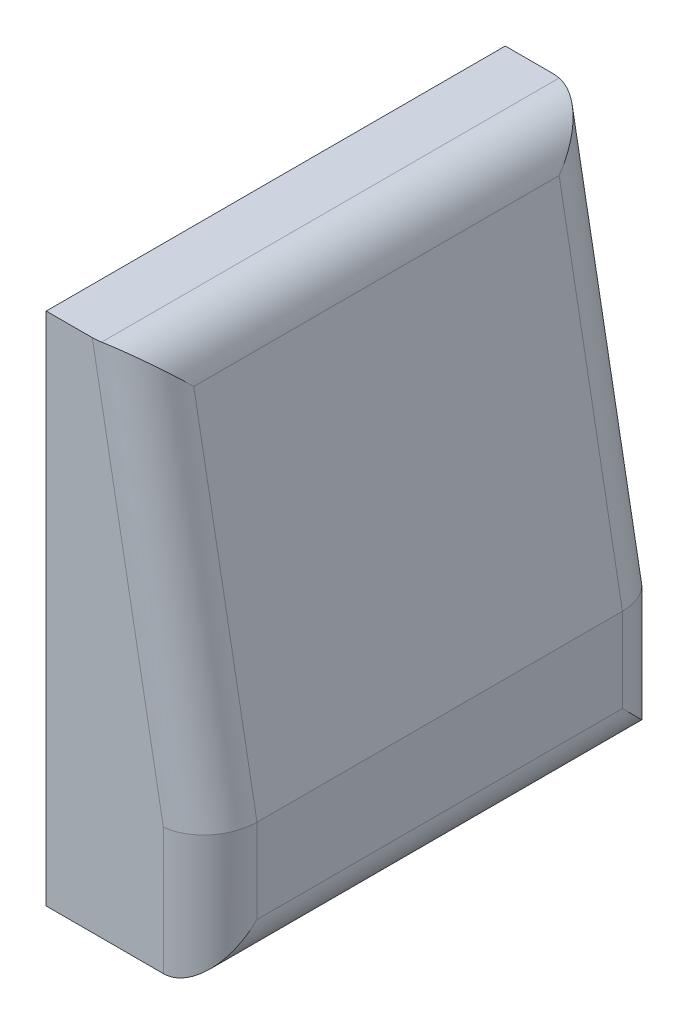
ISO-10303-21;
HEADER;
FILE_DESCRIPTION(('STEP AP214'),'2;1');
FILE_NAME('part.step','',(''),(''),'','','');
FILE_SCHEMA(('AUTOMOTIVE_DESIGN { 1 0 10303 214 1 1 1 1 }'));
ENDSEC;
DATA;
#1=APPLICATION_CONTEXT('core data for automotive mechanical design processes');
#2=APPLICATION_PROTOCOL_DEFINITION('international standard','automotive_design',2000,#1);
#3=PRODUCT_CONTEXT('',#1,'mechanical');
#4=PRODUCT('Part','Part','',(#3));
#5=PRODUCT_RELATED_PRODUCT_CATEGORY('part','',(#4));
#6=PRODUCT_DEFINITION_FORMATION('','',#4);
#7=PRODUCT_DEFINITION_CONTEXT('part definition',#1,'design');
#8=PRODUCT_DEFINITION('design','',#6,#7);
#9=PRODUCT_DEFINITION_SHAPE('','',#8);
#10=(LENGTH_UNIT() NAMED_UNIT(*) SI_UNIT(.MILLI.,.METRE.));
#11=(NAMED_UNIT(*) PLANE_ANGLE_UNIT() SI_UNIT($,.RADIAN.));
#12=(NAMED_UNIT(*) SI_UNIT($,.STERADIAN.) SOLID_ANGLE_UNIT());
#13=UNCERTAINTY_MEASURE_WITH_UNIT(LENGTH_MEASURE(1.E-05),#10,'distance_accuracy_value','');
#14=(GEOMETRIC_REPRESENTATION_CONTEXT(3) GLOBAL_UNCERTAINTY_ASSIGNED_CONTEXT((#13)) GLOBAL_UNIT_ASSIGNED_CONTEXT((#10,
#11,#12)) REPRESENTATION_CONTEXT('',''));
#15=CARTESIAN_POINT('',(0.,0.,0.));
#16=DIRECTION('',(0.,0.,1.));
#17=DIRECTION('',(1.,0.,0.));
#18=AXIS2_PLACEMENT_3D('',#15,#16,#17);
#19=CARTESIAN_POINT('',(200.,1100.,490.));
#20=DIRECTION('',(0.,-1.,0.));
#21=DIRECTION('',(0.,0.,-1.));
#22=AXIS2_PLACEMENT_3D('',#19,#20,#21);
#23=PLANE('',#22);
#24=DIRECTION('',(0.,0.,-1.));
#25=VECTOR('',#24,1.);
#26=CARTESIAN_POINT('',(116.633338798208,1100.,490.));
#27=LINE('',#26,#25);
#28=CARTESIAN_POINT('',(116.633338798208,1100.,488.367740670723));
#29=VERTEX_POINT('',#28);
#30=CARTESIAN_POINT('',(116.633338798208,1100.,-488.367740670723));
#31=VERTEX_POINT('',#30);
#32=EDGE_CURVE('E167',#29,#31,#27,.T.);
#33=ORIENTED_EDGE('',*,*,#32,.T.);
#34=CARTESIAN_POINT('',(98.3406558713784,1100.,-390.));
#35=DIRECTION('',(0.,-1.,0.));
#36=DIRECTION('',(-1.,0.,0.));
#37=AXIS2_PLACEMENT_3D('',#34,#35,#36);
#38=ELLIPSE('',#37,101.659344128622,100.);
#39=CARTESIAN_POINT('',(98.3406558713784,1100.,-490.));
#40=VERTEX_POINT('',#39);
#41=EDGE_CURVE('E173',#31,#40,#38,.F.);
#42=ORIENTED_EDGE('',*,*,#41,.T.);
#43=DIRECTION('',(-1.,0.,0.));
#44=VECTOR('',#43,1.);
#45=CARTESIAN_POINT('',(200.,1100.,-490.));
#46=LINE('',#45,#44);
#47=CARTESIAN_POINT('',(0.,1100.,-490.));
#48=VERTEX_POINT('',#47);
#49=EDGE_CURVE('E132',#40,#48,#46,.T.);
#50=ORIENTED_EDGE('',*,*,#49,.T.);
#51=DIRECTION('',(0.,0.,-1.));
#52=VECTOR('',#51,1.);
#53=CARTESIAN_POINT('',(0.,1100.,490.));
#54=LINE('',#53,#52);
#55=CARTESIAN_POINT('',(0.,1100.,490.));
#56=VERTEX_POINT('',#55);
#57=EDGE_CURVE('E125',#56,#48,#54,.T.);
#58=ORIENTED_EDGE('',*,*,#57,.F.);
#59=DIRECTION('',(-1.,0.,0.));
#60=VECTOR('',#59,1.);
#61=CARTESIAN_POINT('',(200.,1100.,490.));
#62=LINE('',#61,#60);
#63=CARTESIAN_POINT('',(98.3406558713784,1100.,490.));
#64=VERTEX_POINT('',#63);
#65=EDGE_CURVE('E111',#64,#56,#62,.T.);
#66=ORIENTED_EDGE('',*,*,#65,.F.);
#67=CARTESIAN_POINT('',(98.3406558713784,1100.,390.));
#68=DIRECTION('',(0.,-1.,0.));
#69=DIRECTION('',(1.,0.,0.));
#70=AXIS2_PLACEMENT_3D('',#67,#68,#69);
#71=ELLIPSE('',#70,101.659344128622,100.);
#72=EDGE_CURVE('E170',#64,#29,#71,.F.);
#73=ORIENTED_EDGE('',*,*,#72,.T.);
#74=EDGE_LOOP('',(#33,#42,#50,#58,#66,#73));
#75=FACE_BOUND('',#74,.T.);
#76=ADVANCED_FACE('F39',(#75),#23,.F.);
#77=CARTESIAN_POINT('',(0.,1100.,490.));
#78=DIRECTION('',(1.,0.,0.));
#79=DIRECTION('',(0.,0.,-1.));
#80=AXIS2_PLACEMENT_3D('',#77,#78,#79);
#81=PLANE('',#80);
#82=DIRECTION('',(0.,-1.,0.));
#83=VECTOR('',#82,1.);
#84=CARTESIAN_POINT('',(0.,1100.,-490.));
#85=LINE('',#84,#83);
#86=CARTESIAN_POINT('',(0.,0.,-490.));
#87=VERTEX_POINT('',#86);
#88=EDGE_CURVE('E206',#48,#87,#85,.T.);
#89=ORIENTED_EDGE('',*,*,#88,.T.);
#90=DIRECTION('',(0.,0.,-1.));
#91=VECTOR('',#90,1.);
#92=CARTESIAN_POINT('',(0.,0.,490.));
#93=LINE('',#92,#91);
#94=CARTESIAN_POINT('',(0.,0.,490.));
#95=VERTEX_POINT('',#94);
#96=EDGE_CURVE('E127',#95,#87,#93,.T.);
#97=ORIENTED_EDGE('',*,*,#96,.F.);
#98=DIRECTION('',(0.,-1.,0.));
#99=VECTOR('',#98,1.);
#100=CARTESIAN_POINT('',(0.,1100.,490.));
#101=LINE('',#100,#99);
#102=EDGE_CURVE('E114',#56,#95,#101,.T.);
#103=ORIENTED_EDGE('',*,*,#102,.F.);
#104=ORIENTED_EDGE('',*,*,#57,.T.);
#105=EDGE_LOOP('',(#89,#97,#103,#104));
#106=FACE_BOUND('',#105,.T.);
#107=ADVANCED_FACE('F124',(#106),#81,.F.);
#108=CARTESIAN_POINT('',(0.,0.,490.));
#109=DIRECTION('',(0.,1.,0.));
#110=DIRECTION('',(0.,0.,1.));
#111=AXIS2_PLACEMENT_3D('',#108,#109,#110);
#112=PLANE('',#111);
#113=DIRECTION('',(1.,0.,0.));
#114=VECTOR('',#113,1.);
#115=CARTESIAN_POINT('',(0.,0.,-490.));
#116=LINE('',#115,#114);
#117=CARTESIAN_POINT('',(250.,0.,-490.));
#118=VERTEX_POINT('',#117);
#119=EDGE_CURVE('E120',#87,#118,#116,.T.);
#120=ORIENTED_EDGE('',*,*,#119,.T.);
#121=DIRECTION('',(0.,0.,-1.));
#122=VECTOR('',#121,1.);
#123=CARTESIAN_POINT('',(250.,0.,490.));
#124=LINE('',#123,#122);
#125=CARTESIAN_POINT('',(250.,0.,490.));
#126=VERTEX_POINT('',#125);
#127=EDGE_CURVE('E63',#118,#126,#124,.F.);
#128=ORIENTED_EDGE('',*,*,#127,.T.);
#129=DIRECTION('',(1.,0.,0.));
#130=VECTOR('',#129,1.);
#131=CARTESIAN_POINT('',(0.,0.,490.));
#132=LINE('',#131,#130);
#133=EDGE_CURVE('E129',#95,#126,#132,.T.);
#134=ORIENTED_EDGE('',*,*,#133,.F.);
#135=ORIENTED_EDGE('',*,*,#96,.T.);
#136=EDGE_LOOP('',(#120,#128,#134,#135));
#137=FACE_BOUND('',#136,.T.);
#138=ADVANCED_FACE('F251',(#137),#112,.F.);
#139=CARTESIAN_POINT('',(350.,0.,490.));
#140=DIRECTION('',(-1.,0.,0.));
#141=DIRECTION('',(0.,0.,1.));
#142=AXIS2_PLACEMENT_3D('',#139,#140,#141);
#143=PLANE('',#142);
#144=DIRECTION('',(0.,0.,-1.));
#145=VECTOR('',#144,1.);
#146=CARTESIAN_POINT('',(350.,100.,490.));
#147=LINE('',#146,#145);
#148=CARTESIAN_POINT('',(350.,100.,390.));
#149=VERTEX_POINT('',#148);
#150=CARTESIAN_POINT('',(350.,100.,-390.));
#151=VERTEX_POINT('',#150);
#152=EDGE_CURVE('E139',#149,#151,#147,.T.);
#153=ORIENTED_EDGE('',*,*,#152,.T.);
#154=DIRECTION('',(0.,1.,0.));
#155=VECTOR('',#154,1.);
#156=CARTESIAN_POINT('',(350.,0.,-390.));
#157=LINE('',#156,#155);
#158=CARTESIAN_POINT('',(350.,280.,-390.));
#159=VERTEX_POINT('',#158);
#160=EDGE_CURVE('E147',#151,#159,#157,.T.);
#161=ORIENTED_EDGE('',*,*,#160,.T.);
#162=DIRECTION('',(0.,0.,-1.));
#163=VECTOR('',#162,1.);
#164=CARTESIAN_POINT('',(350.,280.,490.));
#165=LINE('',#164,#163);
#166=CARTESIAN_POINT('',(350.,280.,390.));
#167=VERTEX_POINT('',#166);
#168=EDGE_CURVE('E141',#167,#159,#165,.T.);
#169=ORIENTED_EDGE('',*,*,#168,.F.);
#170=DIRECTION('',(0.,1.,0.));
#171=VECTOR('',#170,1.);
#172=CARTESIAN_POINT('',(350.,0.,390.));
#173=LINE('',#172,#171);
#174=EDGE_CURVE('E135',#167,#149,#173,.F.);
#175=ORIENTED_EDGE('',*,*,#174,.T.);
#176=EDGE_LOOP('',(#153,#161,#169,#175));
#177=FACE_BOUND('',#176,.T.);
#178=ADVANCED_FACE('F226',(#177),#143,.F.);
#179=CARTESIAN_POINT('',(350.,280.,490.));
#180=DIRECTION('',(-0.983677406707226,-0.17994098903181,0.));
#181=DIRECTION('',(0.17994098903181,-0.983677406707226,0.));
#182=AXIS2_PLACEMENT_3D('',#179,#180,#181);
#183=PLANE('',#182);
#184=ORIENTED_EDGE('',*,*,#168,.T.);
#185=DIRECTION('',(-0.17994098903181,0.983677406707226,0.));
#186=VECTOR('',#185,1.);
#187=CARTESIAN_POINT('',(350.,280.,-390.));
#188=LINE('',#187,#186);
#189=CARTESIAN_POINT('',(215.00107946893,1017.99409890318,-390.));
#190=VERTEX_POINT('',#189);
#191=EDGE_CURVE('E164',#159,#190,#188,.T.);
#192=ORIENTED_EDGE('',*,*,#191,.T.);
#193=DIRECTION('',(0.,0.,-1.));
#194=VECTOR('',#193,1.);
#195=CARTESIAN_POINT('',(215.00107946893,1017.99409890318,490.));
#196=LINE('',#195,#194);
#197=CARTESIAN_POINT('',(215.00107946893,1017.99409890318,390.));
#198=VERTEX_POINT('',#197);
#199=EDGE_CURVE('E158',#190,#198,#196,.F.);
#200=ORIENTED_EDGE('',*,*,#199,.T.);
#201=DIRECTION('',(-0.17994098903181,0.983677406707226,0.));
#202=VECTOR('',#201,1.);
#203=CARTESIAN_POINT('',(350.,280.,390.));
#204=LINE('',#203,#202);
#205=EDGE_CURVE('E161',#198,#167,#204,.F.);
#206=ORIENTED_EDGE('',*,*,#205,.T.);
#207=EDGE_LOOP('',(#184,#192,#200,#206));
#208=FACE_BOUND('',#207,.T.);
#209=ADVANCED_FACE('F243',(#208),#183,.F.);
#210=CARTESIAN_POINT('',(0.,0.,490.));
#211=DIRECTION('',(0.,0.,1.));
#212=DIRECTION('',(1.,0.,0.));
#213=AXIS2_PLACEMENT_3D('',#210,#211,#212);
#214=PLANE('',#213);
#215=ORIENTED_EDGE('',*,*,#133,.T.);
#216=DIRECTION('',(0.,1.,0.));
#217=VECTOR('',#216,1.);
#218=CARTESIAN_POINT('',(250.,280.,490.));
#219=LINE('',#218,#217);
#220=CARTESIAN_POINT('',(250.,270.928918763536,490.));
#221=VERTEX_POINT('',#220);
#222=EDGE_CURVE('E11',#126,#221,#219,.T.);
#223=ORIENTED_EDGE('',*,*,#222,.T.);
#224=DIRECTION('',(-0.17994098903181,0.983677406707226,0.));
#225=VECTOR('',#224,1.);
#226=CARTESIAN_POINT('',(101.632259329277,1082.00590109682,490.));
#227=LINE('',#226,#225);
#228=EDGE_CURVE('E49',#221,#64,#227,.T.);
#229=ORIENTED_EDGE('',*,*,#228,.T.);
#230=ORIENTED_EDGE('',*,*,#65,.T.);
#231=ORIENTED_EDGE('',*,*,#102,.T.);
#232=EDGE_LOOP('',(#215,#223,#229,#230,#231));
#233=FACE_BOUND('',#232,.T.);
#234=ADVANCED_FACE('F113',(#233),#214,.T.);
#235=CARTESIAN_POINT('',(0.,0.,-490.));
#236=DIRECTION('',(0.,0.,1.));
#237=DIRECTION('',(1.,0.,0.));
#238=AXIS2_PLACEMENT_3D('',#235,#236,#237);
#239=PLANE('',#238);
#240=DIRECTION('',(-0.17994098903181,0.983677406707226,0.));
#241=VECTOR('',#240,1.);
#242=CARTESIAN_POINT('',(289.860781418787,53.0233136741683,-490.));
#243=LINE('',#242,#241);
#244=CARTESIAN_POINT('',(250.,270.928918763535,-490.));
#245=VERTEX_POINT('',#244);
#246=EDGE_CURVE('E151',#40,#245,#243,.F.);
#247=ORIENTED_EDGE('',*,*,#246,.T.);
#248=DIRECTION('',(0.,1.,0.));
#249=VECTOR('',#248,1.);
#250=CARTESIAN_POINT('',(250.,0.,-490.));
#251=LINE('',#250,#249);
#252=EDGE_CURVE('E154',#245,#118,#251,.F.);
#253=ORIENTED_EDGE('',*,*,#252,.T.);
#254=ORIENTED_EDGE('',*,*,#119,.F.);
#255=ORIENTED_EDGE('',*,*,#88,.F.);
#256=ORIENTED_EDGE('',*,*,#49,.F.);
#257=EDGE_LOOP('',(#247,#253,#254,#255,#256));
#258=FACE_BOUND('',#257,.T.);
#259=ADVANCED_FACE('F239',(#258),#239,.F.);
#260=CARTESIAN_POINT('',(289.860781418787,53.0233136741683,390.));
#261=DIRECTION('',(0.17994098903181,-0.983677406707226,0.));
#262=DIRECTION('',(0.983677406707226,0.17994098903181,0.));
#263=AXIS2_PLACEMENT_3D('',#260,#261,#262);
#264=CYLINDRICAL_SURFACE('',#263,100.);
#265=ORIENTED_EDGE('',*,*,#72,.F.);
#266=ORIENTED_EDGE('',*,*,#228,.F.);
#267=CARTESIAN_POINT('',(250.,270.928918763536,390.));
#268=DIRECTION('',(0.0903398950983827,-0.995910991682296,0.));
#269=DIRECTION('',(0.995910991682295,0.0903398950983824,0.));
#270=AXIS2_PLACEMENT_3D('',#267,#268,#269);
#271=ELLIPSE('',#270,100.410579695561,100.);
#272=EDGE_CURVE('E43',#167,#221,#271,.T.);
#273=ORIENTED_EDGE('',*,*,#272,.F.);
#274=ORIENTED_EDGE('',*,*,#205,.F.);
#275=CARTESIAN_POINT('',(116.633338798208,1000.,390.));
#276=DIRECTION('',(-0.127237493557807,0.695564964782677,-0.707106781186547));
#277=DIRECTION('',(0.127237493557807,-0.695564964782677,-0.707106781186547));
#278=AXIS2_PLACEMENT_3D('',#275,#276,#277);
#279=ELLIPSE('',#278,141.42135623731,100.);
#280=EDGE_CURVE('E193',#29,#198,#279,.T.);
#281=ORIENTED_EDGE('',*,*,#280,.F.);
#282=EDGE_LOOP('',(#265,#266,#273,#274,#281));
#283=FACE_BOUND('',#282,.T.);
#284=ADVANCED_FACE('F41',(#283),#264,.T.);
#285=CARTESIAN_POINT('',(250.,0.,390.));
#286=DIRECTION('',(0.,-1.,0.));
#287=DIRECTION('',(0.,0.,-1.));
#288=AXIS2_PLACEMENT_3D('',#285,#286,#287);
#289=CYLINDRICAL_SURFACE('',#288,100.);
#290=ORIENTED_EDGE('',*,*,#272,.T.);
#291=ORIENTED_EDGE('',*,*,#222,.F.);
#292=CARTESIAN_POINT('',(250.,100.,390.));
#293=DIRECTION('',(0.,-0.707106781186547,-0.707106781186547));
#294=DIRECTION('',(0.,-0.707106781186547,0.707106781186547));
#295=AXIS2_PLACEMENT_3D('',#292,#293,#294);
#296=ELLIPSE('',#295,141.42135623731,100.);
#297=EDGE_CURVE('E190',#149,#126,#296,.T.);
#298=ORIENTED_EDGE('',*,*,#297,.F.);
#299=ORIENTED_EDGE('',*,*,#174,.F.);
#300=EDGE_LOOP('',(#290,#291,#298,#299));
#301=FACE_BOUND('',#300,.T.);
#302=ADVANCED_FACE('F219',(#301),#289,.T.);
#303=CARTESIAN_POINT('',(116.633338798208,1000.,490.));
#304=DIRECTION('',(0.,0.,-1.));
#305=DIRECTION('',(-1.,0.,0.));
#306=AXIS2_PLACEMENT_3D('',#303,#304,#305);
#307=CYLINDRICAL_SURFACE('',#306,100.);
#308=ORIENTED_EDGE('',*,*,#280,.T.);
#309=ORIENTED_EDGE('',*,*,#199,.F.);
#310=CARTESIAN_POINT('',(116.633338798208,1000.,-390.));
#311=DIRECTION('',(0.127237493557807,-0.695564964782677,-0.707106781186547));
#312=DIRECTION('',(-0.127237493557807,0.695564964782677,-0.707106781186547));
#313=AXIS2_PLACEMENT_3D('',#310,#311,#312);
#314=ELLIPSE('',#313,141.42135623731,100.);
#315=EDGE_CURVE('E186',#31,#190,#314,.T.);
#316=ORIENTED_EDGE('',*,*,#315,.F.);
#317=ORIENTED_EDGE('',*,*,#32,.F.);
#318=EDGE_LOOP('',(#308,#309,#316,#317));
#319=FACE_BOUND('',#318,.T.);
#320=ADVANCED_FACE('F231',(#319),#307,.T.);
#321=CARTESIAN_POINT('',(250.,100.,490.));
#322=DIRECTION('',(0.,0.,-1.));
#323=DIRECTION('',(-1.,0.,0.));
#324=AXIS2_PLACEMENT_3D('',#321,#322,#323);
#325=CYLINDRICAL_SURFACE('',#324,100.);
#326=ORIENTED_EDGE('',*,*,#297,.T.);
#327=ORIENTED_EDGE('',*,*,#127,.F.);
#328=CARTESIAN_POINT('',(250.,100.,-390.));
#329=DIRECTION('',(0.,0.707106781186547,-0.707106781186547));
#330=DIRECTION('',(0.,-0.707106781186547,-0.707106781186547));
#331=AXIS2_PLACEMENT_3D('',#328,#329,#330);
#332=ELLIPSE('',#331,141.42135623731,100.);
#333=EDGE_CURVE('E183',#151,#118,#332,.T.);
#334=ORIENTED_EDGE('',*,*,#333,.F.);
#335=ORIENTED_EDGE('',*,*,#152,.F.);
#336=EDGE_LOOP('',(#326,#327,#334,#335));
#337=FACE_BOUND('',#336,.T.);
#338=ADVANCED_FACE('F222',(#337),#325,.T.);
#339=CARTESIAN_POINT('',(251.632259329277,262.005901096819,-390.));
#340=DIRECTION('',(-0.17994098903181,0.983677406707226,0.));
#341=DIRECTION('',(-0.983677406707226,-0.17994098903181,0.));
#342=AXIS2_PLACEMENT_3D('',#339,#340,#341);
#343=CYLINDRICAL_SURFACE('',#342,100.);
#344=ORIENTED_EDGE('',*,*,#315,.T.);
#345=ORIENTED_EDGE('',*,*,#191,.F.);
#346=CARTESIAN_POINT('',(250.,270.928918763536,-390.));
#347=DIRECTION('',(-0.0903398950983827,0.995910991682296,0.));
#348=DIRECTION('',(-0.995910991682295,-0.0903398950983824,0.));
#349=AXIS2_PLACEMENT_3D('',#346,#347,#348);
#350=ELLIPSE('',#349,100.410579695561,100.);
#351=EDGE_CURVE('E180',#245,#159,#350,.F.);
#352=ORIENTED_EDGE('',*,*,#351,.F.);
#353=ORIENTED_EDGE('',*,*,#246,.F.);
#354=ORIENTED_EDGE('',*,*,#41,.F.);
#355=EDGE_LOOP('',(#344,#345,#352,#353,#354));
#356=FACE_BOUND('',#355,.T.);
#357=ADVANCED_FACE('F235',(#356),#343,.T.);
#358=CARTESIAN_POINT('',(250.,0.,-390.));
#359=DIRECTION('',(0.,1.,0.));
#360=DIRECTION('',(0.,0.,1.));
#361=AXIS2_PLACEMENT_3D('',#358,#359,#360);
#362=CYLINDRICAL_SURFACE('',#361,100.);
#363=ORIENTED_EDGE('',*,*,#333,.T.);
#364=ORIENTED_EDGE('',*,*,#252,.F.);
#365=ORIENTED_EDGE('',*,*,#351,.T.);
#366=ORIENTED_EDGE('',*,*,#160,.F.);
#367=EDGE_LOOP('',(#363,#364,#365,#366));
#368=FACE_BOUND('',#367,.T.);
#369=ADVANCED_FACE('F242',(#368),#362,.T.);
#370=CLOSED_SHELL('',(#76,#107,#138,#178,#209,#234,#259,#284,#302,#320,#338,#357,#369));
#371=MANIFOLD_SOLID_BREP('B2',#370);
#372=ADVANCED_BREP_SHAPE_REPRESENTATION('',(#18,#371),#14);
#373=SHAPE_DEFINITION_REPRESENTATION(#9,#372);
ENDSEC;
END-ISO-10303-21;
